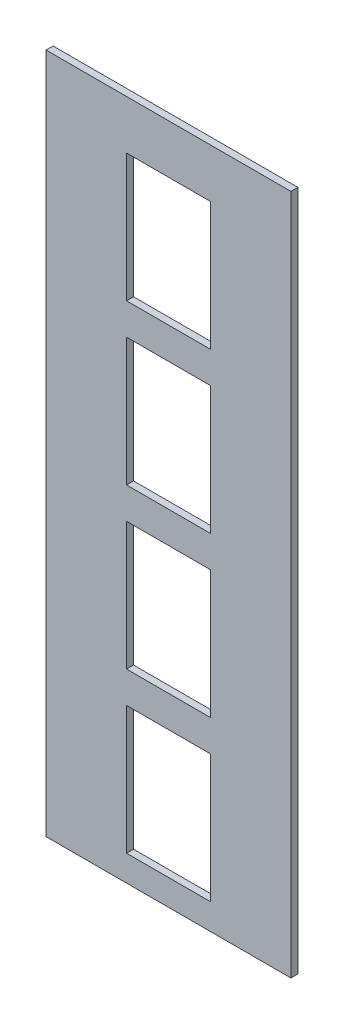
ISO-10303-21;
HEADER;
FILE_DESCRIPTION(('STEP AP214'),'2;1');
FILE_NAME('part.step','',(''),(''),'','','');
FILE_SCHEMA(('AUTOMOTIVE_DESIGN { 1 0 10303 214 1 1 1 1 }'));
ENDSEC;
DATA;
#1=APPLICATION_CONTEXT('core data for automotive mechanical design processes');
#2=APPLICATION_PROTOCOL_DEFINITION('international standard','automotive_design',2000,#1);
#3=PRODUCT_CONTEXT('',#1,'mechanical');
#4=PRODUCT('Part','Part','',(#3));
#5=PRODUCT_RELATED_PRODUCT_CATEGORY('part','',(#4));
#6=PRODUCT_DEFINITION_FORMATION('','',#4);
#7=PRODUCT_DEFINITION_CONTEXT('part definition',#1,'design');
#8=PRODUCT_DEFINITION('design','',#6,#7);
#9=PRODUCT_DEFINITION_SHAPE('','',#8);
#10=(LENGTH_UNIT() NAMED_UNIT(*) SI_UNIT(.MILLI.,.METRE.));
#11=(NAMED_UNIT(*) PLANE_ANGLE_UNIT() SI_UNIT($,.RADIAN.));
#12=(NAMED_UNIT(*) SI_UNIT($,.STERADIAN.) SOLID_ANGLE_UNIT());
#13=UNCERTAINTY_MEASURE_WITH_UNIT(LENGTH_MEASURE(1.E-05),#10,'distance_accuracy_value','');
#14=(GEOMETRIC_REPRESENTATION_CONTEXT(3) GLOBAL_UNCERTAINTY_ASSIGNED_CONTEXT((#13)) GLOBAL_UNIT_ASSIGNED_CONTEXT((#10,
#11,#12)) REPRESENTATION_CONTEXT('',''));
#15=CARTESIAN_POINT('',(0.,0.,0.));
#16=DIRECTION('',(0.,0.,1.));
#17=DIRECTION('',(1.,0.,0.));
#18=AXIS2_PLACEMENT_3D('',#15,#16,#17);
#19=CARTESIAN_POINT('',(0.,0.,10.));
#20=DIRECTION('',(0.,0.,-1.));
#21=DIRECTION('',(-1.,0.,0.));
#22=AXIS2_PLACEMENT_3D('',#19,#20,#21);
#23=PLANE('',#22);
#24=DIRECTION('',(-1.,0.,0.));
#25=VECTOR('',#24,1.);
#26=CARTESIAN_POINT('',(109.999999999998,676.,10.));
#27=LINE('',#26,#25);
#28=CARTESIAN_POINT('',(229.999999999998,676.,10.));
#29=VERTEX_POINT('',#28);
#30=CARTESIAN_POINT('',(109.999999999998,676.,10.));
#31=VERTEX_POINT('',#30);
#32=EDGE_CURVE('E269',#29,#31,#27,.T.);
#33=ORIENTED_EDGE('',*,*,#32,.F.);
#34=DIRECTION('',(0.,1.,0.));
#35=VECTOR('',#34,1.);
#36=CARTESIAN_POINT('',(229.999999999998,493.,10.));
#37=LINE('',#36,#35);
#38=CARTESIAN_POINT('',(229.999999999998,493.,10.));
#39=VERTEX_POINT('',#38);
#40=EDGE_CURVE('E257',#39,#29,#37,.T.);
#41=ORIENTED_EDGE('',*,*,#40,.F.);
#42=DIRECTION('',(1.,0.,0.));
#43=VECTOR('',#42,1.);
#44=CARTESIAN_POINT('',(109.999999999998,493.,10.));
#45=LINE('',#44,#43);
#46=CARTESIAN_POINT('',(109.999999999998,493.,10.));
#47=VERTEX_POINT('',#46);
#48=EDGE_CURVE('E261',#47,#39,#45,.T.);
#49=ORIENTED_EDGE('',*,*,#48,.F.);
#50=DIRECTION('',(0.,-1.,0.));
#51=VECTOR('',#50,1.);
#52=CARTESIAN_POINT('',(109.999999999998,493.,10.));
#53=LINE('',#52,#51);
#54=EDGE_CURVE('E265',#31,#47,#53,.T.);
#55=ORIENTED_EDGE('',*,*,#54,.F.);
#56=EDGE_LOOP('',(#33,#41,#49,#55));
#57=FACE_BOUND('',#56,.T.);
#58=DIRECTION('',(0.,1.,0.));
#59=VECTOR('',#58,1.);
#60=CARTESIAN_POINT('',(230.,37.,10.));
#61=LINE('',#60,#59);
#62=CARTESIAN_POINT('',(230.,37.,10.));
#63=VERTEX_POINT('',#62);
#64=CARTESIAN_POINT('',(230.,220.,10.));
#65=VERTEX_POINT('',#64);
#66=EDGE_CURVE('E173',#63,#65,#61,.T.);
#67=ORIENTED_EDGE('',*,*,#66,.F.);
#68=DIRECTION('',(1.,0.,0.));
#69=VECTOR('',#68,1.);
#70=CARTESIAN_POINT('',(110.,37.,10.));
#71=LINE('',#70,#69);
#72=CARTESIAN_POINT('',(110.,37.,10.));
#73=VERTEX_POINT('',#72);
#74=EDGE_CURVE('E161',#73,#63,#71,.T.);
#75=ORIENTED_EDGE('',*,*,#74,.F.);
#76=DIRECTION('',(0.,-1.,0.));
#77=VECTOR('',#76,1.);
#78=CARTESIAN_POINT('',(110.,37.,10.));
#79=LINE('',#78,#77);
#80=CARTESIAN_POINT('',(110.,220.,10.));
#81=VERTEX_POINT('',#80);
#82=EDGE_CURVE('E165',#81,#73,#79,.T.);
#83=ORIENTED_EDGE('',*,*,#82,.F.);
#84=DIRECTION('',(-1.,0.,0.));
#85=VECTOR('',#84,1.);
#86=CARTESIAN_POINT('',(110.,220.,10.));
#87=LINE('',#86,#85);
#88=EDGE_CURVE('E169',#65,#81,#87,.T.);
#89=ORIENTED_EDGE('',*,*,#88,.F.);
#90=EDGE_LOOP('',(#67,#75,#83,#89));
#91=FACE_BOUND('',#90,.T.);
#92=DIRECTION('',(0.,-1.,0.));
#93=VECTOR('',#92,1.);
#94=CARTESIAN_POINT('',(-5.,0.,10.));
#95=LINE('',#94,#93);
#96=CARTESIAN_POINT('',(-5.,974.,10.));
#97=VERTEX_POINT('',#96);
#98=CARTESIAN_POINT('',(-5.,0.,10.));
#99=VERTEX_POINT('',#98);
#100=EDGE_CURVE('E127',#97,#99,#95,.T.);
#101=ORIENTED_EDGE('',*,*,#100,.T.);
#102=DIRECTION('',(1.,0.,0.));
#103=VECTOR('',#102,1.);
#104=CARTESIAN_POINT('',(0.,0.,10.));
#105=LINE('',#104,#103);
#106=CARTESIAN_POINT('',(345.,0.,10.));
#107=VERTEX_POINT('',#106);
#108=EDGE_CURVE('E97',#99,#107,#105,.T.);
#109=ORIENTED_EDGE('',*,*,#108,.T.);
#110=DIRECTION('',(0.,1.,0.));
#111=VECTOR('',#110,1.);
#112=CARTESIAN_POINT('',(345.,0.,10.));
#113=LINE('',#112,#111);
#114=CARTESIAN_POINT('',(345.,974.,10.));
#115=VERTEX_POINT('',#114);
#116=EDGE_CURVE('E90',#107,#115,#113,.T.);
#117=ORIENTED_EDGE('',*,*,#116,.T.);
#118=DIRECTION('',(-1.,0.,0.));
#119=VECTOR('',#118,1.);
#120=CARTESIAN_POINT('',(0.,974.,10.));
#121=LINE('',#120,#119);
#122=EDGE_CURVE('E95',#115,#97,#121,.T.);
#123=ORIENTED_EDGE('',*,*,#122,.T.);
#124=EDGE_LOOP('',(#101,#109,#117,#123));
#125=FACE_BOUND('',#124,.T.);
#126=DIRECTION('',(-1.,0.,0.));
#127=VECTOR('',#126,1.);
#128=CARTESIAN_POINT('',(109.999999999999,448.,10.));
#129=LINE('',#128,#127);
#130=CARTESIAN_POINT('',(229.999999999999,448.,10.));
#131=VERTEX_POINT('',#130);
#132=CARTESIAN_POINT('',(109.999999999999,448.,10.));
#133=VERTEX_POINT('',#132);
#134=EDGE_CURVE('E221',#131,#133,#129,.T.);
#135=ORIENTED_EDGE('',*,*,#134,.F.);
#136=DIRECTION('',(0.,1.,0.));
#137=VECTOR('',#136,1.);
#138=CARTESIAN_POINT('',(229.999999999999,265.,10.));
#139=LINE('',#138,#137);
#140=CARTESIAN_POINT('',(229.999999999999,265.,10.));
#141=VERTEX_POINT('',#140);
#142=EDGE_CURVE('E209',#141,#131,#139,.T.);
#143=ORIENTED_EDGE('',*,*,#142,.F.);
#144=DIRECTION('',(1.,0.,0.));
#145=VECTOR('',#144,1.);
#146=CARTESIAN_POINT('',(109.999999999999,265.,10.));
#147=LINE('',#146,#145);
#148=CARTESIAN_POINT('',(109.999999999999,265.,10.));
#149=VERTEX_POINT('',#148);
#150=EDGE_CURVE('E213',#149,#141,#147,.T.);
#151=ORIENTED_EDGE('',*,*,#150,.F.);
#152=DIRECTION('',(0.,-1.,0.));
#153=VECTOR('',#152,1.);
#154=CARTESIAN_POINT('',(109.999999999999,265.,10.));
#155=LINE('',#154,#153);
#156=EDGE_CURVE('E217',#133,#149,#155,.T.);
#157=ORIENTED_EDGE('',*,*,#156,.F.);
#158=EDGE_LOOP('',(#135,#143,#151,#157));
#159=FACE_BOUND('',#158,.T.);
#160=DIRECTION('',(-1.,0.,0.));
#161=VECTOR('',#160,1.);
#162=CARTESIAN_POINT('',(109.999999999998,904.,10.));
#163=LINE('',#162,#161);
#164=CARTESIAN_POINT('',(229.999999999998,904.,10.));
#165=VERTEX_POINT('',#164);
#166=CARTESIAN_POINT('',(109.999999999998,904.,10.));
#167=VERTEX_POINT('',#166);
#168=EDGE_CURVE('E313',#165,#167,#163,.T.);
#169=ORIENTED_EDGE('',*,*,#168,.F.);
#170=DIRECTION('',(0.,1.,0.));
#171=VECTOR('',#170,1.);
#172=CARTESIAN_POINT('',(229.999999999998,721.,10.));
#173=LINE('',#172,#171);
#174=CARTESIAN_POINT('',(229.999999999998,721.,10.));
#175=VERTEX_POINT('',#174);
#176=EDGE_CURVE('E303',#175,#165,#173,.T.);
#177=ORIENTED_EDGE('',*,*,#176,.F.);
#178=DIRECTION('',(1.,0.,0.));
#179=VECTOR('',#178,1.);
#180=CARTESIAN_POINT('',(109.999999999998,721.,10.));
#181=LINE('',#180,#179);
#182=CARTESIAN_POINT('',(109.999999999998,721.,10.));
#183=VERTEX_POINT('',#182);
#184=EDGE_CURVE('E306',#183,#175,#181,.T.);
#185=ORIENTED_EDGE('',*,*,#184,.F.);
#186=DIRECTION('',(0.,-1.,0.));
#187=VECTOR('',#186,1.);
#188=CARTESIAN_POINT('',(109.999999999998,721.,10.));
#189=LINE('',#188,#187);
#190=EDGE_CURVE('E309',#167,#183,#189,.T.);
#191=ORIENTED_EDGE('',*,*,#190,.F.);
#192=EDGE_LOOP('',(#169,#177,#185,#191));
#193=FACE_BOUND('',#192,.T.);
#194=ADVANCED_FACE('F40',(#57,#91,#125,#159,#193),#23,.F.);
#195=CARTESIAN_POINT('',(0.,0.,0.));
#196=DIRECTION('',(0.,0.,-1.));
#197=DIRECTION('',(-1.,0.,0.));
#198=AXIS2_PLACEMENT_3D('',#195,#196,#197);
#199=PLANE('',#198);
#200=DIRECTION('',(0.,-1.,0.));
#201=VECTOR('',#200,1.);
#202=CARTESIAN_POINT('',(-5.,0.,0.));
#203=LINE('',#202,#201);
#204=CARTESIAN_POINT('',(-5.,974.,0.));
#205=VERTEX_POINT('',#204);
#206=CARTESIAN_POINT('',(-5.,0.,0.));
#207=VERTEX_POINT('',#206);
#208=EDGE_CURVE('E123',#205,#207,#203,.T.);
#209=ORIENTED_EDGE('',*,*,#208,.F.);
#210=DIRECTION('',(-1.,0.,0.));
#211=VECTOR('',#210,1.);
#212=CARTESIAN_POINT('',(0.,974.,0.));
#213=LINE('',#212,#211);
#214=CARTESIAN_POINT('',(345.,974.,0.));
#215=VERTEX_POINT('',#214);
#216=EDGE_CURVE('E124',#215,#205,#213,.T.);
#217=ORIENTED_EDGE('',*,*,#216,.F.);
#218=DIRECTION('',(0.,1.,0.));
#219=VECTOR('',#218,1.);
#220=CARTESIAN_POINT('',(345.,0.,0.));
#221=LINE('',#220,#219);
#222=CARTESIAN_POINT('',(345.,0.,0.));
#223=VERTEX_POINT('',#222);
#224=EDGE_CURVE('E105',#223,#215,#221,.T.);
#225=ORIENTED_EDGE('',*,*,#224,.F.);
#226=DIRECTION('',(1.,0.,0.));
#227=VECTOR('',#226,1.);
#228=CARTESIAN_POINT('',(0.,0.,0.));
#229=LINE('',#228,#227);
#230=EDGE_CURVE('E120',#207,#223,#229,.T.);
#231=ORIENTED_EDGE('',*,*,#230,.F.);
#232=EDGE_LOOP('',(#209,#217,#225,#231));
#233=FACE_BOUND('',#232,.T.);
#234=DIRECTION('',(1.,0.,0.));
#235=VECTOR('',#234,1.);
#236=CARTESIAN_POINT('',(110.,37.,0.));
#237=LINE('',#236,#235);
#238=CARTESIAN_POINT('',(110.,37.,0.));
#239=VERTEX_POINT('',#238);
#240=CARTESIAN_POINT('',(230.,37.,0.));
#241=VERTEX_POINT('',#240);
#242=EDGE_CURVE('E177',#239,#241,#237,.T.);
#243=ORIENTED_EDGE('',*,*,#242,.T.);
#244=DIRECTION('',(0.,1.,0.));
#245=VECTOR('',#244,1.);
#246=CARTESIAN_POINT('',(230.,37.,0.));
#247=LINE('',#246,#245);
#248=CARTESIAN_POINT('',(230.,220.,0.));
#249=VERTEX_POINT('',#248);
#250=EDGE_CURVE('E189',#241,#249,#247,.T.);
#251=ORIENTED_EDGE('',*,*,#250,.T.);
#252=DIRECTION('',(-1.,0.,0.));
#253=VECTOR('',#252,1.);
#254=CARTESIAN_POINT('',(110.,220.,0.));
#255=LINE('',#254,#253);
#256=CARTESIAN_POINT('',(110.,220.,0.));
#257=VERTEX_POINT('',#256);
#258=EDGE_CURVE('E185',#249,#257,#255,.T.);
#259=ORIENTED_EDGE('',*,*,#258,.T.);
#260=DIRECTION('',(0.,-1.,0.));
#261=VECTOR('',#260,1.);
#262=CARTESIAN_POINT('',(110.,37.,0.));
#263=LINE('',#262,#261);
#264=EDGE_CURVE('E181',#257,#239,#263,.T.);
#265=ORIENTED_EDGE('',*,*,#264,.T.);
#266=EDGE_LOOP('',(#243,#251,#259,#265));
#267=FACE_BOUND('',#266,.T.);
#268=DIRECTION('',(0.,1.,0.));
#269=VECTOR('',#268,1.);
#270=CARTESIAN_POINT('',(229.999999999999,265.,0.));
#271=LINE('',#270,#269);
#272=CARTESIAN_POINT('',(229.999999999999,265.,0.));
#273=VERTEX_POINT('',#272);
#274=CARTESIAN_POINT('',(229.999999999999,448.,0.));
#275=VERTEX_POINT('',#274);
#276=EDGE_CURVE('E225',#273,#275,#271,.T.);
#277=ORIENTED_EDGE('',*,*,#276,.T.);
#278=DIRECTION('',(-1.,0.,0.));
#279=VECTOR('',#278,1.);
#280=CARTESIAN_POINT('',(109.999999999999,448.,0.));
#281=LINE('',#280,#279);
#282=CARTESIAN_POINT('',(109.999999999999,448.,0.));
#283=VERTEX_POINT('',#282);
#284=EDGE_CURVE('E237',#275,#283,#281,.T.);
#285=ORIENTED_EDGE('',*,*,#284,.T.);
#286=DIRECTION('',(0.,-1.,0.));
#287=VECTOR('',#286,1.);
#288=CARTESIAN_POINT('',(109.999999999999,265.,0.));
#289=LINE('',#288,#287);
#290=CARTESIAN_POINT('',(109.999999999999,265.,0.));
#291=VERTEX_POINT('',#290);
#292=EDGE_CURVE('E233',#283,#291,#289,.T.);
#293=ORIENTED_EDGE('',*,*,#292,.T.);
#294=DIRECTION('',(1.,0.,0.));
#295=VECTOR('',#294,1.);
#296=CARTESIAN_POINT('',(109.999999999999,265.,0.));
#297=LINE('',#296,#295);
#298=EDGE_CURVE('E229',#291,#273,#297,.T.);
#299=ORIENTED_EDGE('',*,*,#298,.T.);
#300=EDGE_LOOP('',(#277,#285,#293,#299));
#301=FACE_BOUND('',#300,.T.);
#302=DIRECTION('',(0.,1.,0.));
#303=VECTOR('',#302,1.);
#304=CARTESIAN_POINT('',(229.999999999998,493.,0.));
#305=LINE('',#304,#303);
#306=CARTESIAN_POINT('',(229.999999999998,493.,0.));
#307=VERTEX_POINT('',#306);
#308=CARTESIAN_POINT('',(229.999999999998,676.,0.));
#309=VERTEX_POINT('',#308);
#310=EDGE_CURVE('E273',#307,#309,#305,.T.);
#311=ORIENTED_EDGE('',*,*,#310,.T.);
#312=DIRECTION('',(-1.,0.,0.));
#313=VECTOR('',#312,1.);
#314=CARTESIAN_POINT('',(109.999999999998,676.,0.));
#315=LINE('',#314,#313);
#316=CARTESIAN_POINT('',(109.999999999998,676.,0.));
#317=VERTEX_POINT('',#316);
#318=EDGE_CURVE('E285',#309,#317,#315,.T.);
#319=ORIENTED_EDGE('',*,*,#318,.T.);
#320=DIRECTION('',(0.,-1.,0.));
#321=VECTOR('',#320,1.);
#322=CARTESIAN_POINT('',(109.999999999998,493.,0.));
#323=LINE('',#322,#321);
#324=CARTESIAN_POINT('',(109.999999999998,493.,0.));
#325=VERTEX_POINT('',#324);
#326=EDGE_CURVE('E281',#317,#325,#323,.T.);
#327=ORIENTED_EDGE('',*,*,#326,.T.);
#328=DIRECTION('',(1.,0.,0.));
#329=VECTOR('',#328,1.);
#330=CARTESIAN_POINT('',(109.999999999998,493.,0.));
#331=LINE('',#330,#329);
#332=EDGE_CURVE('E277',#325,#307,#331,.T.);
#333=ORIENTED_EDGE('',*,*,#332,.T.);
#334=EDGE_LOOP('',(#311,#319,#327,#333));
#335=FACE_BOUND('',#334,.T.);
#336=DIRECTION('',(0.,1.,0.));
#337=VECTOR('',#336,1.);
#338=CARTESIAN_POINT('',(229.999999999998,721.,0.));
#339=LINE('',#338,#337);
#340=CARTESIAN_POINT('',(229.999999999998,721.,0.));
#341=VERTEX_POINT('',#340);
#342=CARTESIAN_POINT('',(229.999999999998,904.,0.));
#343=VERTEX_POINT('',#342);
#344=EDGE_CURVE('E317',#341,#343,#339,.T.);
#345=ORIENTED_EDGE('',*,*,#344,.T.);
#346=DIRECTION('',(-1.,0.,0.));
#347=VECTOR('',#346,1.);
#348=CARTESIAN_POINT('',(109.999999999998,904.,0.));
#349=LINE('',#348,#347);
#350=CARTESIAN_POINT('',(109.999999999998,904.,0.));
#351=VERTEX_POINT('',#350);
#352=EDGE_CURVE('E329',#343,#351,#349,.T.);
#353=ORIENTED_EDGE('',*,*,#352,.T.);
#354=DIRECTION('',(0.,-1.,0.));
#355=VECTOR('',#354,1.);
#356=CARTESIAN_POINT('',(109.999999999998,721.,0.));
#357=LINE('',#356,#355);
#358=CARTESIAN_POINT('',(109.999999999998,721.,0.));
#359=VERTEX_POINT('',#358);
#360=EDGE_CURVE('E325',#351,#359,#357,.T.);
#361=ORIENTED_EDGE('',*,*,#360,.T.);
#362=DIRECTION('',(1.,0.,0.));
#363=VECTOR('',#362,1.);
#364=CARTESIAN_POINT('',(109.999999999998,721.,0.));
#365=LINE('',#364,#363);
#366=EDGE_CURVE('E321',#359,#341,#365,.T.);
#367=ORIENTED_EDGE('',*,*,#366,.T.);
#368=EDGE_LOOP('',(#345,#353,#361,#367));
#369=FACE_BOUND('',#368,.T.);
#370=ADVANCED_FACE('F140',(#233,#267,#301,#335,#369),#199,.T.);
#371=CARTESIAN_POINT('',(-5.,0.,10.));
#372=DIRECTION('',(1.,0.,0.));
#373=DIRECTION('',(0.,0.,-1.));
#374=AXIS2_PLACEMENT_3D('',#371,#372,#373);
#375=PLANE('',#374);
#376=ORIENTED_EDGE('',*,*,#208,.T.);
#377=DIRECTION('',(0.,0.,-1.));
#378=VECTOR('',#377,1.);
#379=CARTESIAN_POINT('',(-5.,0.,10.));
#380=LINE('',#379,#378);
#381=EDGE_CURVE('E12',#99,#207,#380,.T.);
#382=ORIENTED_EDGE('',*,*,#381,.F.);
#383=ORIENTED_EDGE('',*,*,#100,.F.);
#384=DIRECTION('',(0.,0.,-1.));
#385=VECTOR('',#384,1.);
#386=CARTESIAN_POINT('',(-5.,974.,10.));
#387=LINE('',#386,#385);
#388=EDGE_CURVE('E109',#97,#205,#387,.T.);
#389=ORIENTED_EDGE('',*,*,#388,.T.);
#390=EDGE_LOOP('',(#376,#382,#383,#389));
#391=FACE_BOUND('',#390,.T.);
#392=ADVANCED_FACE('F143',(#391),#375,.F.);
#393=CARTESIAN_POINT('',(0.,0.,10.));
#394=DIRECTION('',(0.,1.,0.));
#395=DIRECTION('',(0.,0.,1.));
#396=AXIS2_PLACEMENT_3D('',#393,#394,#395);
#397=PLANE('',#396);
#398=ORIENTED_EDGE('',*,*,#230,.T.);
#399=DIRECTION('',(0.,0.,-1.));
#400=VECTOR('',#399,1.);
#401=CARTESIAN_POINT('',(345.,0.,10.));
#402=LINE('',#401,#400);
#403=EDGE_CURVE('E51',#107,#223,#402,.T.);
#404=ORIENTED_EDGE('',*,*,#403,.F.);
#405=ORIENTED_EDGE('',*,*,#108,.F.);
#406=ORIENTED_EDGE('',*,*,#381,.T.);
#407=EDGE_LOOP('',(#398,#404,#405,#406));
#408=FACE_BOUND('',#407,.T.);
#409=ADVANCED_FACE('F145',(#408),#397,.F.);
#410=CARTESIAN_POINT('',(345.,0.,10.));
#411=DIRECTION('',(-1.,0.,0.));
#412=DIRECTION('',(0.,0.,1.));
#413=AXIS2_PLACEMENT_3D('',#410,#411,#412);
#414=PLANE('',#413);
#415=ORIENTED_EDGE('',*,*,#224,.T.);
#416=DIRECTION('',(0.,0.,-1.));
#417=VECTOR('',#416,1.);
#418=CARTESIAN_POINT('',(345.,974.,10.));
#419=LINE('',#418,#417);
#420=EDGE_CURVE('E44',#115,#215,#419,.T.);
#421=ORIENTED_EDGE('',*,*,#420,.F.);
#422=ORIENTED_EDGE('',*,*,#116,.F.);
#423=ORIENTED_EDGE('',*,*,#403,.T.);
#424=EDGE_LOOP('',(#415,#421,#422,#423));
#425=FACE_BOUND('',#424,.T.);
#426=ADVANCED_FACE('F42',(#425),#414,.F.);
#427=CARTESIAN_POINT('',(0.,974.,10.));
#428=DIRECTION('',(0.,-1.,0.));
#429=DIRECTION('',(0.,0.,-1.));
#430=AXIS2_PLACEMENT_3D('',#427,#428,#429);
#431=PLANE('',#430);
#432=ORIENTED_EDGE('',*,*,#216,.T.);
#433=ORIENTED_EDGE('',*,*,#388,.F.);
#434=ORIENTED_EDGE('',*,*,#122,.F.);
#435=ORIENTED_EDGE('',*,*,#420,.T.);
#436=EDGE_LOOP('',(#432,#433,#434,#435));
#437=FACE_BOUND('',#436,.T.);
#438=ADVANCED_FACE('F110',(#437),#431,.F.);
#439=CARTESIAN_POINT('',(230.,37.,10.));
#440=DIRECTION('',(-1.,0.,0.));
#441=DIRECTION('',(0.,0.,1.));
#442=AXIS2_PLACEMENT_3D('',#439,#440,#441);
#443=PLANE('',#442);
#444=ORIENTED_EDGE('',*,*,#250,.F.);
#445=DIRECTION('',(0.,0.,-1.));
#446=VECTOR('',#445,1.);
#447=CARTESIAN_POINT('',(230.,37.,10.));
#448=LINE('',#447,#446);
#449=EDGE_CURVE('E157',#63,#241,#448,.T.);
#450=ORIENTED_EDGE('',*,*,#449,.F.);
#451=ORIENTED_EDGE('',*,*,#66,.T.);
#452=DIRECTION('',(0.,0.,-1.));
#453=VECTOR('',#452,1.);
#454=CARTESIAN_POINT('',(230.,220.,10.));
#455=LINE('',#454,#453);
#456=EDGE_CURVE('E130',#65,#249,#455,.T.);
#457=ORIENTED_EDGE('',*,*,#456,.T.);
#458=EDGE_LOOP('',(#444,#450,#451,#457));
#459=FACE_BOUND('',#458,.T.);
#460=ADVANCED_FACE('F447',(#459),#443,.T.);
#461=CARTESIAN_POINT('',(110.,220.,10.));
#462=DIRECTION('',(0.,-1.,0.));
#463=DIRECTION('',(0.,0.,-1.));
#464=AXIS2_PLACEMENT_3D('',#461,#462,#463);
#465=PLANE('',#464);
#466=ORIENTED_EDGE('',*,*,#258,.F.);
#467=ORIENTED_EDGE('',*,*,#456,.F.);
#468=ORIENTED_EDGE('',*,*,#88,.T.);
#469=DIRECTION('',(0.,0.,-1.));
#470=VECTOR('',#469,1.);
#471=CARTESIAN_POINT('',(110.,220.,10.));
#472=LINE('',#471,#470);
#473=EDGE_CURVE('E150',#81,#257,#472,.T.);
#474=ORIENTED_EDGE('',*,*,#473,.T.);
#475=EDGE_LOOP('',(#466,#467,#468,#474));
#476=FACE_BOUND('',#475,.T.);
#477=ADVANCED_FACE('F466',(#476),#465,.T.);
#478=CARTESIAN_POINT('',(110.,37.,10.));
#479=DIRECTION('',(1.,0.,0.));
#480=DIRECTION('',(0.,0.,-1.));
#481=AXIS2_PLACEMENT_3D('',#478,#479,#480);
#482=PLANE('',#481);
#483=ORIENTED_EDGE('',*,*,#264,.F.);
#484=ORIENTED_EDGE('',*,*,#473,.F.);
#485=ORIENTED_EDGE('',*,*,#82,.T.);
#486=DIRECTION('',(0.,0.,-1.));
#487=VECTOR('',#486,1.);
#488=CARTESIAN_POINT('',(110.,37.,10.));
#489=LINE('',#488,#487);
#490=EDGE_CURVE('E153',#73,#239,#489,.T.);
#491=ORIENTED_EDGE('',*,*,#490,.T.);
#492=EDGE_LOOP('',(#483,#484,#485,#491));
#493=FACE_BOUND('',#492,.T.);
#494=ADVANCED_FACE('F472',(#493),#482,.T.);
#495=CARTESIAN_POINT('',(110.,37.,10.));
#496=DIRECTION('',(0.,1.,0.));
#497=DIRECTION('',(0.,0.,1.));
#498=AXIS2_PLACEMENT_3D('',#495,#496,#497);
#499=PLANE('',#498);
#500=ORIENTED_EDGE('',*,*,#242,.F.);
#501=ORIENTED_EDGE('',*,*,#490,.F.);
#502=ORIENTED_EDGE('',*,*,#74,.T.);
#503=ORIENTED_EDGE('',*,*,#449,.T.);
#504=EDGE_LOOP('',(#500,#501,#502,#503));
#505=FACE_BOUND('',#504,.T.);
#506=ADVANCED_FACE('F480',(#505),#499,.T.);
#507=CARTESIAN_POINT('',(109.999999999999,448.,10.));
#508=DIRECTION('',(0.,-1.,0.));
#509=DIRECTION('',(0.,0.,-1.));
#510=AXIS2_PLACEMENT_3D('',#507,#508,#509);
#511=PLANE('',#510);
#512=ORIENTED_EDGE('',*,*,#284,.F.);
#513=DIRECTION('',(0.,0.,-1.));
#514=VECTOR('',#513,1.);
#515=CARTESIAN_POINT('',(229.999999999999,448.,10.));
#516=LINE('',#515,#514);
#517=EDGE_CURVE('E205',#131,#275,#516,.T.);
#518=ORIENTED_EDGE('',*,*,#517,.F.);
#519=ORIENTED_EDGE('',*,*,#134,.T.);
#520=DIRECTION('',(0.,0.,-1.));
#521=VECTOR('',#520,1.);
#522=CARTESIAN_POINT('',(109.999999999999,448.,10.));
#523=LINE('',#522,#521);
#524=EDGE_CURVE('E193',#133,#283,#523,.T.);
#525=ORIENTED_EDGE('',*,*,#524,.T.);
#526=EDGE_LOOP('',(#512,#518,#519,#525));
#527=FACE_BOUND('',#526,.T.);
#528=ADVANCED_FACE('F488',(#527),#511,.T.);
#529=CARTESIAN_POINT('',(109.999999999999,265.,10.));
#530=DIRECTION('',(1.,0.,0.));
#531=DIRECTION('',(0.,0.,-1.));
#532=AXIS2_PLACEMENT_3D('',#529,#530,#531);
#533=PLANE('',#532);
#534=ORIENTED_EDGE('',*,*,#292,.F.);
#535=ORIENTED_EDGE('',*,*,#524,.F.);
#536=ORIENTED_EDGE('',*,*,#156,.T.);
#537=DIRECTION('',(0.,0.,-1.));
#538=VECTOR('',#537,1.);
#539=CARTESIAN_POINT('',(109.999999999999,265.,10.));
#540=LINE('',#539,#538);
#541=EDGE_CURVE('E197',#149,#291,#540,.T.);
#542=ORIENTED_EDGE('',*,*,#541,.T.);
#543=EDGE_LOOP('',(#534,#535,#536,#542));
#544=FACE_BOUND('',#543,.T.);
#545=ADVANCED_FACE('F496',(#544),#533,.T.);
#546=CARTESIAN_POINT('',(109.999999999999,265.,10.));
#547=DIRECTION('',(0.,1.,0.));
#548=DIRECTION('',(0.,0.,1.));
#549=AXIS2_PLACEMENT_3D('',#546,#547,#548);
#550=PLANE('',#549);
#551=ORIENTED_EDGE('',*,*,#298,.F.);
#552=ORIENTED_EDGE('',*,*,#541,.F.);
#553=ORIENTED_EDGE('',*,*,#150,.T.);
#554=DIRECTION('',(0.,0.,-1.));
#555=VECTOR('',#554,1.);
#556=CARTESIAN_POINT('',(229.999999999999,265.,10.));
#557=LINE('',#556,#555);
#558=EDGE_CURVE('E201',#141,#273,#557,.T.);
#559=ORIENTED_EDGE('',*,*,#558,.T.);
#560=EDGE_LOOP('',(#551,#552,#553,#559));
#561=FACE_BOUND('',#560,.T.);
#562=ADVANCED_FACE('F504',(#561),#550,.T.);
#563=CARTESIAN_POINT('',(229.999999999999,265.,10.));
#564=DIRECTION('',(-1.,0.,0.));
#565=DIRECTION('',(0.,0.,1.));
#566=AXIS2_PLACEMENT_3D('',#563,#564,#565);
#567=PLANE('',#566);
#568=ORIENTED_EDGE('',*,*,#276,.F.);
#569=ORIENTED_EDGE('',*,*,#558,.F.);
#570=ORIENTED_EDGE('',*,*,#142,.T.);
#571=ORIENTED_EDGE('',*,*,#517,.T.);
#572=EDGE_LOOP('',(#568,#569,#570,#571));
#573=FACE_BOUND('',#572,.T.);
#574=ADVANCED_FACE('F512',(#573),#567,.T.);
#575=CARTESIAN_POINT('',(109.999999999998,676.,10.));
#576=DIRECTION('',(0.,-1.,0.));
#577=DIRECTION('',(0.,0.,-1.));
#578=AXIS2_PLACEMENT_3D('',#575,#576,#577);
#579=PLANE('',#578);
#580=ORIENTED_EDGE('',*,*,#318,.F.);
#581=DIRECTION('',(0.,0.,-1.));
#582=VECTOR('',#581,1.);
#583=CARTESIAN_POINT('',(229.999999999998,676.,10.));
#584=LINE('',#583,#582);
#585=EDGE_CURVE('E253',#29,#309,#584,.T.);
#586=ORIENTED_EDGE('',*,*,#585,.F.);
#587=ORIENTED_EDGE('',*,*,#32,.T.);
#588=DIRECTION('',(0.,0.,-1.));
#589=VECTOR('',#588,1.);
#590=CARTESIAN_POINT('',(109.999999999998,676.,10.));
#591=LINE('',#590,#589);
#592=EDGE_CURVE('E241',#31,#317,#591,.T.);
#593=ORIENTED_EDGE('',*,*,#592,.T.);
#594=EDGE_LOOP('',(#580,#586,#587,#593));
#595=FACE_BOUND('',#594,.T.);
#596=ADVANCED_FACE('F431',(#595),#579,.T.);
#597=CARTESIAN_POINT('',(109.999999999998,493.,10.));
#598=DIRECTION('',(1.,0.,0.));
#599=DIRECTION('',(0.,0.,-1.));
#600=AXIS2_PLACEMENT_3D('',#597,#598,#599);
#601=PLANE('',#600);
#602=ORIENTED_EDGE('',*,*,#326,.F.);
#603=ORIENTED_EDGE('',*,*,#592,.F.);
#604=ORIENTED_EDGE('',*,*,#54,.T.);
#605=DIRECTION('',(0.,0.,-1.));
#606=VECTOR('',#605,1.);
#607=CARTESIAN_POINT('',(109.999999999998,493.,10.));
#608=LINE('',#607,#606);
#609=EDGE_CURVE('E245',#47,#325,#608,.T.);
#610=ORIENTED_EDGE('',*,*,#609,.T.);
#611=EDGE_LOOP('',(#602,#603,#604,#610));
#612=FACE_BOUND('',#611,.T.);
#613=ADVANCED_FACE('F433',(#612),#601,.T.);
#614=CARTESIAN_POINT('',(109.999999999998,493.,10.));
#615=DIRECTION('',(0.,1.,0.));
#616=DIRECTION('',(0.,0.,1.));
#617=AXIS2_PLACEMENT_3D('',#614,#615,#616);
#618=PLANE('',#617);
#619=ORIENTED_EDGE('',*,*,#332,.F.);
#620=ORIENTED_EDGE('',*,*,#609,.F.);
#621=ORIENTED_EDGE('',*,*,#48,.T.);
#622=DIRECTION('',(0.,0.,-1.));
#623=VECTOR('',#622,1.);
#624=CARTESIAN_POINT('',(229.999999999998,493.,10.));
#625=LINE('',#624,#623);
#626=EDGE_CURVE('E249',#39,#307,#625,.T.);
#627=ORIENTED_EDGE('',*,*,#626,.T.);
#628=EDGE_LOOP('',(#619,#620,#621,#627));
#629=FACE_BOUND('',#628,.T.);
#630=ADVANCED_FACE('F424',(#629),#618,.T.);
#631=CARTESIAN_POINT('',(229.999999999998,493.,10.));
#632=DIRECTION('',(-1.,0.,0.));
#633=DIRECTION('',(0.,0.,1.));
#634=AXIS2_PLACEMENT_3D('',#631,#632,#633);
#635=PLANE('',#634);
#636=ORIENTED_EDGE('',*,*,#310,.F.);
#637=ORIENTED_EDGE('',*,*,#626,.F.);
#638=ORIENTED_EDGE('',*,*,#40,.T.);
#639=ORIENTED_EDGE('',*,*,#585,.T.);
#640=EDGE_LOOP('',(#636,#637,#638,#639));
#641=FACE_BOUND('',#640,.T.);
#642=ADVANCED_FACE('F417',(#641),#635,.T.);
#643=CARTESIAN_POINT('',(109.999999999998,904.,10.));
#644=DIRECTION('',(0.,-1.,0.));
#645=DIRECTION('',(0.,0.,-1.));
#646=AXIS2_PLACEMENT_3D('',#643,#644,#645);
#647=PLANE('',#646);
#648=ORIENTED_EDGE('',*,*,#352,.F.);
#649=DIRECTION('',(0.,0.,-1.));
#650=VECTOR('',#649,1.);
#651=CARTESIAN_POINT('',(229.999999999998,904.,10.));
#652=LINE('',#651,#650);
#653=EDGE_CURVE('E299',#165,#343,#652,.T.);
#654=ORIENTED_EDGE('',*,*,#653,.F.);
#655=ORIENTED_EDGE('',*,*,#168,.T.);
#656=DIRECTION('',(0.,0.,-1.));
#657=VECTOR('',#656,1.);
#658=CARTESIAN_POINT('',(109.999999999998,904.,10.));
#659=LINE('',#658,#657);
#660=EDGE_CURVE('E289',#167,#351,#659,.T.);
#661=ORIENTED_EDGE('',*,*,#660,.T.);
#662=EDGE_LOOP('',(#648,#654,#655,#661));
#663=FACE_BOUND('',#662,.T.);
#664=ADVANCED_FACE('F340',(#663),#647,.T.);
#665=CARTESIAN_POINT('',(109.999999999998,721.,10.));
#666=DIRECTION('',(1.,0.,0.));
#667=DIRECTION('',(0.,0.,-1.));
#668=AXIS2_PLACEMENT_3D('',#665,#666,#667);
#669=PLANE('',#668);
#670=ORIENTED_EDGE('',*,*,#360,.F.);
#671=ORIENTED_EDGE('',*,*,#660,.F.);
#672=ORIENTED_EDGE('',*,*,#190,.T.);
#673=DIRECTION('',(0.,0.,-1.));
#674=VECTOR('',#673,1.);
#675=CARTESIAN_POINT('',(109.999999999998,721.,10.));
#676=LINE('',#675,#674);
#677=EDGE_CURVE('E293',#183,#359,#676,.T.);
#678=ORIENTED_EDGE('',*,*,#677,.T.);
#679=EDGE_LOOP('',(#670,#671,#672,#678));
#680=FACE_BOUND('',#679,.T.);
#681=ADVANCED_FACE('F356',(#680),#669,.T.);
#682=CARTESIAN_POINT('',(109.999999999998,721.,10.));
#683=DIRECTION('',(0.,1.,0.));
#684=DIRECTION('',(0.,0.,1.));
#685=AXIS2_PLACEMENT_3D('',#682,#683,#684);
#686=PLANE('',#685);
#687=ORIENTED_EDGE('',*,*,#366,.F.);
#688=ORIENTED_EDGE('',*,*,#677,.F.);
#689=ORIENTED_EDGE('',*,*,#184,.T.);
#690=DIRECTION('',(0.,0.,-1.));
#691=VECTOR('',#690,1.);
#692=CARTESIAN_POINT('',(229.999999999998,721.,10.));
#693=LINE('',#692,#691);
#694=EDGE_CURVE('E60',#175,#341,#693,.T.);
#695=ORIENTED_EDGE('',*,*,#694,.T.);
#696=EDGE_LOOP('',(#687,#688,#689,#695));
#697=FACE_BOUND('',#696,.T.);
#698=ADVANCED_FACE('F361',(#697),#686,.T.);
#699=CARTESIAN_POINT('',(229.999999999998,721.,10.));
#700=DIRECTION('',(-1.,0.,0.));
#701=DIRECTION('',(0.,0.,1.));
#702=AXIS2_PLACEMENT_3D('',#699,#700,#701);
#703=PLANE('',#702);
#704=ORIENTED_EDGE('',*,*,#344,.F.);
#705=ORIENTED_EDGE('',*,*,#694,.F.);
#706=ORIENTED_EDGE('',*,*,#176,.T.);
#707=ORIENTED_EDGE('',*,*,#653,.T.);
#708=EDGE_LOOP('',(#704,#705,#706,#707));
#709=FACE_BOUND('',#708,.T.);
#710=ADVANCED_FACE('F344',(#709),#703,.T.);
#711=CLOSED_SHELL('',(#194,#370,#392,#409,#426,#438,#460,#477,#494,#506,#528,#545,#562,#574,
#596,#613,#630,#642,#664,#681,#698,#710));
#712=MANIFOLD_SOLID_BREP('B2',#711);
#713=ADVANCED_BREP_SHAPE_REPRESENTATION('',(#18,#712),#14);
#714=SHAPE_DEFINITION_REPRESENTATION(#9,#713);
ENDSEC;
END-ISO-10303-21;
